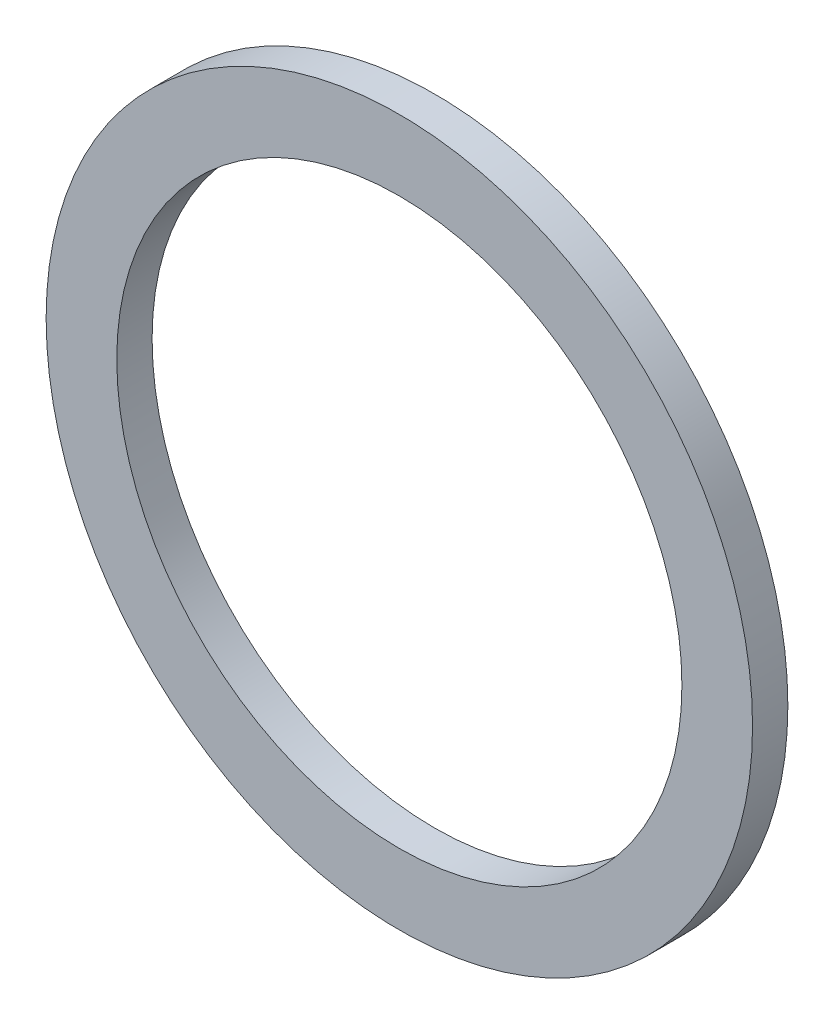
ISO-10303-21;
HEADER;
FILE_DESCRIPTION(('STEP AP214'),'2;1');
FILE_NAME('part.step','',(''),(''),'','','');
FILE_SCHEMA(('AUTOMOTIVE_DESIGN { 1 0 10303 214 1 1 1 1 }'));
ENDSEC;
DATA;
#1=APPLICATION_CONTEXT('core data for automotive mechanical design processes');
#2=APPLICATION_PROTOCOL_DEFINITION('international standard','automotive_design',2000,#1);
#3=PRODUCT_CONTEXT('',#1,'mechanical');
#4=PRODUCT('Part','Part','',(#3));
#5=PRODUCT_RELATED_PRODUCT_CATEGORY('part','',(#4));
#6=PRODUCT_DEFINITION_FORMATION('','',#4);
#7=PRODUCT_DEFINITION_CONTEXT('part definition',#1,'design');
#8=PRODUCT_DEFINITION('design','',#6,#7);
#9=PRODUCT_DEFINITION_SHAPE('','',#8);
#10=(LENGTH_UNIT() NAMED_UNIT(*) SI_UNIT(.MILLI.,.METRE.));
#11=(NAMED_UNIT(*) PLANE_ANGLE_UNIT() SI_UNIT($,.RADIAN.));
#12=(NAMED_UNIT(*) SI_UNIT($,.STERADIAN.) SOLID_ANGLE_UNIT());
#13=UNCERTAINTY_MEASURE_WITH_UNIT(LENGTH_MEASURE(1.E-05),#10,'distance_accuracy_value','');
#14=(GEOMETRIC_REPRESENTATION_CONTEXT(3) GLOBAL_UNCERTAINTY_ASSIGNED_CONTEXT((#13)) GLOBAL_UNIT_ASSIGNED_CONTEXT((#10,
#11,#12)) REPRESENTATION_CONTEXT('',''));
#15=CARTESIAN_POINT('',(0.,0.,0.));
#16=DIRECTION('',(0.,0.,1.));
#17=DIRECTION('',(1.,0.,0.));
#18=AXIS2_PLACEMENT_3D('',#15,#16,#17);
#19=CARTESIAN_POINT('',(8.00000011920929,-6.66666669646899,2.));
#20=DIRECTION('',(0.,0.,-1.));
#21=DIRECTION('',(0.,-1.,0.));
#22=AXIS2_PLACEMENT_3D('',#19,#20,#21);
#23=PLANE('',#22);
#24=CARTESIAN_POINT('',(8.00000011920929,-6.66666669646899,2.));
#25=DIRECTION('',(0.,0.,1.));
#26=DIRECTION('',(1.,0.,0.));
#27=AXIS2_PLACEMENT_3D('',#24,#25,#26);
#28=CIRCLE('',#27,0.800000014901161);
#29=CARTESIAN_POINT('',(7.20000010430813,-6.66666669646899,2.));
#30=VERTEX_POINT('',#29);
#31=EDGE_CURVE('E58',#30,#30,#28,.T.);
#32=ORIENTED_EDGE('',*,*,#31,.T.);
#33=EDGE_LOOP('',(#32));
#34=FACE_BOUND('',#33,.T.);
#35=CARTESIAN_POINT('',(8.00000011920929,-6.66666669646899,2.));
#36=DIRECTION('',(0.,0.,-1.));
#37=DIRECTION('',(1.,0.,0.));
#38=AXIS2_PLACEMENT_3D('',#35,#36,#37);
#39=CIRCLE('',#38,1.00000001490116);
#40=CARTESIAN_POINT('',(7.00000010430813,-6.66666669646899,2.));
#41=VERTEX_POINT('',#40);
#42=EDGE_CURVE('E11',#41,#41,#39,.T.);
#43=ORIENTED_EDGE('',*,*,#42,.T.);
#44=EDGE_LOOP('',(#43));
#45=FACE_BOUND('',#44,.T.);
#46=ADVANCED_FACE('F17',(#34,#45),#23,.T.);
#47=CARTESIAN_POINT('',(8.00000011920929,-6.66666669646899,2.1));
#48=DIRECTION('',(0.,0.,-1.));
#49=DIRECTION('',(0.,-1.,0.));
#50=AXIS2_PLACEMENT_3D('',#47,#48,#49);
#51=PLANE('',#50);
#52=CARTESIAN_POINT('',(8.00000011920929,-6.66666669646899,2.1));
#53=DIRECTION('',(0.,0.,1.));
#54=DIRECTION('',(1.,0.,0.));
#55=AXIS2_PLACEMENT_3D('',#52,#53,#54);
#56=CIRCLE('',#55,0.800000014901161);
#57=CARTESIAN_POINT('',(7.20000010430813,-6.66666669646899,2.1));
#58=VERTEX_POINT('',#57);
#59=EDGE_CURVE('E57',#58,#58,#56,.T.);
#60=ORIENTED_EDGE('',*,*,#59,.F.);
#61=EDGE_LOOP('',(#60));
#62=FACE_BOUND('',#61,.T.);
#63=CARTESIAN_POINT('',(8.00000011920929,-6.66666669646899,2.1));
#64=DIRECTION('',(0.,0.,-1.));
#65=DIRECTION('',(1.,0.,0.));
#66=AXIS2_PLACEMENT_3D('',#63,#64,#65);
#67=CIRCLE('',#66,1.00000001490116);
#68=CARTESIAN_POINT('',(7.00000010430813,-6.66666669646899,2.1));
#69=VERTEX_POINT('',#68);
#70=EDGE_CURVE('E63',#69,#69,#67,.T.);
#71=ORIENTED_EDGE('',*,*,#70,.F.);
#72=EDGE_LOOP('',(#71));
#73=FACE_BOUND('',#72,.T.);
#74=ADVANCED_FACE('F75',(#62,#73),#51,.F.);
#75=CARTESIAN_POINT('',(8.00000011920929,-6.66666669646899,2.));
#76=DIRECTION('',(0.,0.,-1.));
#77=DIRECTION('',(1.,0.,0.));
#78=AXIS2_PLACEMENT_3D('',#75,#76,#77);
#79=CYLINDRICAL_SURFACE('',#78,1.00000001490116);
#80=ORIENTED_EDGE('',*,*,#70,.T.);
#81=DIRECTION('',(0.,0.,-1.));
#82=VECTOR('',#81,1.);
#83=CARTESIAN_POINT('',(7.00000010430813,-6.66666669646899,2.));
#84=LINE('',#83,#82);
#85=EDGE_CURVE('E21',#69,#41,#84,.T.);
#86=ORIENTED_EDGE('',*,*,#85,.T.);
#87=ORIENTED_EDGE('',*,*,#42,.F.);
#88=ORIENTED_EDGE('',*,*,#85,.F.);
#89=EDGE_LOOP('',(#80,#86,#87,#88));
#90=FACE_BOUND('',#89,.T.);
#91=ADVANCED_FACE('F73',(#90),#79,.T.);
#92=CARTESIAN_POINT('',(8.00000011920929,-6.66666669646899,2.));
#93=DIRECTION('',(0.,0.,-1.));
#94=DIRECTION('',(1.,0.,0.));
#95=AXIS2_PLACEMENT_3D('',#92,#93,#94);
#96=CYLINDRICAL_SURFACE('',#95,0.800000014901161);
#97=ORIENTED_EDGE('',*,*,#59,.T.);
#98=DIRECTION('',(0.,0.,-1.));
#99=VECTOR('',#98,1.);
#100=CARTESIAN_POINT('',(7.20000010430813,-6.66666669646899,2.));
#101=LINE('',#100,#99);
#102=EDGE_CURVE('E55',#58,#30,#101,.T.);
#103=ORIENTED_EDGE('',*,*,#102,.T.);
#104=ORIENTED_EDGE('',*,*,#31,.F.);
#105=ORIENTED_EDGE('',*,*,#102,.F.);
#106=EDGE_LOOP('',(#97,#103,#104,#105));
#107=FACE_BOUND('',#106,.T.);
#108=ADVANCED_FACE('F19',(#107),#96,.F.);
#109=CLOSED_SHELL('',(#46,#74,#91,#108));
#110=MANIFOLD_SOLID_BREP('B1',#109);
#111=ADVANCED_BREP_SHAPE_REPRESENTATION('',(#18,#110),#14);
#112=SHAPE_DEFINITION_REPRESENTATION(#9,#111);
ENDSEC;
END-ISO-10303-21;
